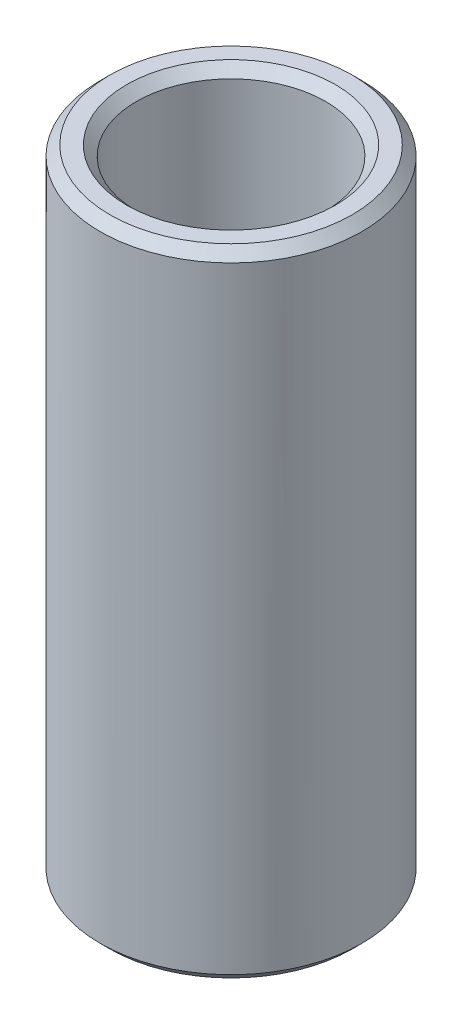
ISO-10303-21;
HEADER;
FILE_DESCRIPTION(('STEP AP214'),'2;1');
FILE_NAME('part.step','',(''),(''),'','','');
FILE_SCHEMA(('AUTOMOTIVE_DESIGN { 1 0 10303 214 1 1 1 1 }'));
ENDSEC;
DATA;
#1=APPLICATION_CONTEXT('core data for automotive mechanical design processes');
#2=APPLICATION_PROTOCOL_DEFINITION('international standard','automotive_design',2000,#1);
#3=PRODUCT_CONTEXT('',#1,'mechanical');
#4=PRODUCT('Part','Part','',(#3));
#5=PRODUCT_RELATED_PRODUCT_CATEGORY('part','',(#4));
#6=PRODUCT_DEFINITION_FORMATION('','',#4);
#7=PRODUCT_DEFINITION_CONTEXT('part definition',#1,'design');
#8=PRODUCT_DEFINITION('design','',#6,#7);
#9=PRODUCT_DEFINITION_SHAPE('','',#8);
#10=(LENGTH_UNIT() NAMED_UNIT(*) SI_UNIT(.MILLI.,.METRE.));
#11=(NAMED_UNIT(*) PLANE_ANGLE_UNIT() SI_UNIT($,.RADIAN.));
#12=(NAMED_UNIT(*) SI_UNIT($,.STERADIAN.) SOLID_ANGLE_UNIT());
#13=UNCERTAINTY_MEASURE_WITH_UNIT(LENGTH_MEASURE(1.E-05),#10,'distance_accuracy_value','');
#14=(GEOMETRIC_REPRESENTATION_CONTEXT(3) GLOBAL_UNCERTAINTY_ASSIGNED_CONTEXT((#13)) GLOBAL_UNIT_ASSIGNED_CONTEXT((#10,
#11,#12)) REPRESENTATION_CONTEXT('',''));
#15=CARTESIAN_POINT('',(0.,0.,0.));
#16=DIRECTION('',(0.,0.,1.));
#17=DIRECTION('',(1.,0.,0.));
#18=AXIS2_PLACEMENT_3D('',#15,#16,#17);
#19=CARTESIAN_POINT('',(0.,206.517811158155,0.));
#20=DIRECTION('',(0.,-1.,0.));
#21=DIRECTION('',(0.,0.,-1.));
#22=AXIS2_PLACEMENT_3D('',#19,#20,#21);
#23=CYLINDRICAL_SURFACE('',#22,42.5);
#24=CARTESIAN_POINT('',(0.,3.16306866676061,0.));
#25=DIRECTION('',(0.,1.,0.));
#26=DIRECTION('',(0.,0.,1.));
#27=AXIS2_PLACEMENT_3D('',#24,#25,#26);
#28=CIRCLE('',#27,42.5);
#29=CARTESIAN_POINT('',(0.,3.16306866676058,-42.5));
#30=VERTEX_POINT('',#29);
#31=EDGE_CURVE('E10',#30,#30,#28,.T.);
#32=CARTESIAN_POINT('',(0.,203.354742491395,0.));
#33=DIRECTION('',(0.,1.,0.));
#34=DIRECTION('',(0.,0.,1.));
#35=AXIS2_PLACEMENT_3D('',#32,#33,#34);
#36=CIRCLE('',#35,42.5);
#37=CARTESIAN_POINT('',(0.,203.354742491395,-42.5));
#38=VERTEX_POINT('',#37);
#39=EDGE_CURVE('E50',#38,#38,#36,.F.);
#40=CARTESIAN_POINT('',(0.,3.16306866676058,-42.5));
#41=CARTESIAN_POINT('',(0.,5.24839860243386,-42.5));
#42=CARTESIAN_POINT('',(0.,7.33372853810713,-42.5));
#43=CARTESIAN_POINT('',(0.,11.5043884094537,-42.5));
#44=CARTESIAN_POINT('',(0.,13.589718345127,-42.5));
#45=CARTESIAN_POINT('',(0.,17.7603782164735,-42.5));
#46=CARTESIAN_POINT('',(0.,19.8457081521468,-42.5));
#47=CARTESIAN_POINT('',(0.,24.0163680234933,-42.5));
#48=CARTESIAN_POINT('',(0.,26.1016979591666,-42.5));
#49=CARTESIAN_POINT('',(0.,30.2723578305131,-42.5));
#50=CARTESIAN_POINT('',(0.,32.3576877661864,-42.5));
#51=CARTESIAN_POINT('',(0.,36.528347637533,-42.5));
#52=CARTESIAN_POINT('',(0.,38.6136775732062,-42.5));
#53=CARTESIAN_POINT('',(0.,42.7843374445528,-42.5));
#54=CARTESIAN_POINT('',(0.,44.8696673802261,-42.5));
#55=CARTESIAN_POINT('',(0.,49.0403272515726,-42.5));
#56=CARTESIAN_POINT('',(0.,51.1256571872459,-42.5));
#57=CARTESIAN_POINT('',(0.,55.2963170585924,-42.5));
#58=CARTESIAN_POINT('',(0.,57.3816469942657,-42.5));
#59=CARTESIAN_POINT('',(0.,61.5523068656123,-42.5));
#60=CARTESIAN_POINT('',(0.,63.6376368012856,-42.5));
#61=CARTESIAN_POINT('',(0.,67.8082966726321,-42.5));
#62=CARTESIAN_POINT('',(0.,69.8936266083054,-42.5));
#63=CARTESIAN_POINT('',(0.,74.0642864796519,-42.5));
#64=CARTESIAN_POINT('',(0.,76.1496164153252,-42.5));
#65=CARTESIAN_POINT('',(0.,80.3202762866717,-42.5));
#66=CARTESIAN_POINT('',(0.,82.405606222345,-42.5));
#67=CARTESIAN_POINT('',(0.,86.5762660936915,-42.5));
#68=CARTESIAN_POINT('',(0.,88.6615960293648,-42.5));
#69=CARTESIAN_POINT('',(0.,92.8322559007114,-42.5));
#70=CARTESIAN_POINT('',(0.,94.9175858363846,-42.5));
#71=CARTESIAN_POINT('',(0.,99.0882457077312,-42.5));
#72=CARTESIAN_POINT('',(0.,101.173575643404,-42.5));
#73=CARTESIAN_POINT('',(0.,105.344235514751,-42.5));
#74=CARTESIAN_POINT('',(0.,107.429565450424,-42.5));
#75=CARTESIAN_POINT('',(0.,111.600225321771,-42.5));
#76=CARTESIAN_POINT('',(0.,113.685555257444,-42.5));
#77=CARTESIAN_POINT('',(0.,117.856215128791,-42.5));
#78=CARTESIAN_POINT('',(0.,119.941545064464,-42.5));
#79=CARTESIAN_POINT('',(0.,124.11220493581,-42.5));
#80=CARTESIAN_POINT('',(0.,126.197534871484,-42.5));
#81=CARTESIAN_POINT('',(0.,130.36819474283,-42.5));
#82=CARTESIAN_POINT('',(0.,132.453524678504,-42.5));
#83=CARTESIAN_POINT('',(0.,136.62418454985,-42.5));
#84=CARTESIAN_POINT('',(0.,138.709514485523,-42.5));
#85=CARTESIAN_POINT('',(0.,142.88017435687,-42.5));
#86=CARTESIAN_POINT('',(0.,144.965504292543,-42.5));
#87=CARTESIAN_POINT('',(0.,149.13616416389,-42.5));
#88=CARTESIAN_POINT('',(0.,151.221494099563,-42.5));
#89=CARTESIAN_POINT('',(0.,155.39215397091,-42.5));
#90=CARTESIAN_POINT('',(0.,157.477483906583,-42.5));
#91=CARTESIAN_POINT('',(0.,161.648143777929,-42.5));
#92=CARTESIAN_POINT('',(0.,163.733473713603,-42.5));
#93=CARTESIAN_POINT('',(0.,167.904133584949,-42.5));
#94=CARTESIAN_POINT('',(0.,169.989463520623,-42.5));
#95=CARTESIAN_POINT('',(0.,174.160123391969,-42.5));
#96=CARTESIAN_POINT('',(0.,176.245453327642,-42.5));
#97=CARTESIAN_POINT('',(0.,180.416113198989,-42.5));
#98=CARTESIAN_POINT('',(0.,182.501443134662,-42.5));
#99=CARTESIAN_POINT('',(0.,186.672103006009,-42.5));
#100=CARTESIAN_POINT('',(0.,188.757432941682,-42.5));
#101=CARTESIAN_POINT('',(0.,192.928092813029,-42.5));
#102=CARTESIAN_POINT('',(0.,195.013422748702,-42.5));
#103=CARTESIAN_POINT('',(0.,199.184082620048,-42.5));
#104=CARTESIAN_POINT('',(0.,201.269412555722,-42.5));
#105=CARTESIAN_POINT('',(0.,203.354742491395,-42.5));
#106=B_SPLINE_CURVE_WITH_KNOTS('',3,(#40,#41,#42,#43,#44,#45,#46,#47,#48,#49,#50,#51,#52,#53,
#54,#55,#56,#57,#58,#59,#60,#61,#62,#63,#64,#65,#66,#67,#68,#69,#70,#71,#72,#73,#74,#75,#76,#77,
#78,#79,#80,#81,#82,#83,#84,#85,#86,#87,#88,#89,#90,#91,#92,#93,#94,#95,#96,#97,#98,#99,#100,
#101,#102,#103,#104,#105),.UNSPECIFIED.,.F.,.F.,(4,2,2,2,2,2,2,2,2,2,2,2,2,2,2,2,2,2,2,2,2,2,2,
2,2,2,2,2,2,2,2,2,4),(0.,6.25598980701983,12.5119796140397,18.7679694210595,25.0239592280793,
31.2799490350991,37.5359388421189,43.7919286491388,50.0479184561586,56.3039082631784,
62.5598980701982,68.815887877218,75.0718776842379,81.3278674912577,87.5838572982775,
93.8398471052973,100.095836912317,106.351826719337,112.607816526357,118.863806333377,
125.119796140396,131.375785947416,137.631775754436,143.887765561456,150.143755368476,
156.399745175496,162.655734982515,168.911724789535,175.167714596555,181.423704403575,
187.679694210595,193.935684017614,200.191673824634),.UNSPECIFIED.);
#107=EDGE_CURVE('BSEAM39',#30,#38,#106,.T.);
#108=ORIENTED_EDGE('',*,*,#31,.T.);
#109=ORIENTED_EDGE('',*,*,#39,.T.);
#110=ORIENTED_EDGE('',*,*,#107,.T.);
#111=ORIENTED_EDGE('',*,*,#107,.F.);
#112=EDGE_LOOP('',(#108,#110,#109,#111));
#113=FACE_BOUND('',#112,.T.);
#114=ADVANCED_FACE('F39',(#113),#23,.T.);
#115=CARTESIAN_POINT('',(0.,206.517811158155,0.));
#116=DIRECTION('',(0.,1.,0.));
#117=DIRECTION('',(0.,0.,1.));
#118=AXIS2_PLACEMENT_3D('',#115,#116,#117);
#119=PLANE('',#118);
#120=CARTESIAN_POINT('',(0.,206.517811158155,0.));
#121=DIRECTION('',(0.,1.,0.));
#122=DIRECTION('',(0.,0.,1.));
#123=AXIS2_PLACEMENT_3D('',#120,#121,#122);
#124=CIRCLE('',#123,33.9195724445905);
#125=CARTESIAN_POINT('',(0.,206.517811158155,33.9195724445905));
#126=VERTEX_POINT('',#125);
#127=EDGE_CURVE('E58',#126,#126,#124,.F.);
#128=ORIENTED_EDGE('',*,*,#127,.T.);
#129=EDGE_LOOP('',(#128));
#130=FACE_BOUND('',#129,.T.);
#131=CARTESIAN_POINT('',(0.,206.517811158155,0.));
#132=DIRECTION('',(0.,1.,0.));
#133=DIRECTION('',(0.,0.,1.));
#134=AXIS2_PLACEMENT_3D('',#131,#132,#133);
#135=CIRCLE('',#134,39.3369313332396);
#136=CARTESIAN_POINT('',(0.,206.517811158155,39.3369313332396));
#137=VERTEX_POINT('',#136);
#138=EDGE_CURVE('E61',#137,#137,#135,.T.);
#139=ORIENTED_EDGE('',*,*,#138,.T.);
#140=EDGE_LOOP('',(#139));
#141=FACE_BOUND('',#140,.T.);
#142=ADVANCED_FACE('F88',(#130,#141),#119,.T.);
#143=CARTESIAN_POINT('',(0.,0.,0.));
#144=DIRECTION('',(0.,1.,0.));
#145=DIRECTION('',(0.,0.,1.));
#146=AXIS2_PLACEMENT_3D('',#143,#144,#145);
#147=PLANE('',#146);
#148=CARTESIAN_POINT('',(0.,0.,0.));
#149=DIRECTION('',(0.,1.,0.));
#150=DIRECTION('',(0.,0.,1.));
#151=AXIS2_PLACEMENT_3D('',#148,#149,#150);
#152=CIRCLE('',#151,33.9195724445903);
#153=CARTESIAN_POINT('',(0.,0.,33.9195724445903));
#154=VERTEX_POINT('',#153);
#155=EDGE_CURVE('E51',#154,#154,#152,.T.);
#156=ORIENTED_EDGE('',*,*,#155,.T.);
#157=EDGE_LOOP('',(#156));
#158=FACE_BOUND('',#157,.T.);
#159=CARTESIAN_POINT('',(0.,0.,0.));
#160=DIRECTION('',(0.,1.,0.));
#161=DIRECTION('',(0.,0.,1.));
#162=AXIS2_PLACEMENT_3D('',#159,#160,#161);
#163=CIRCLE('',#162,39.3369313332394);
#164=CARTESIAN_POINT('',(0.,0.,39.3369313332394));
#165=VERTEX_POINT('',#164);
#166=EDGE_CURVE('E54',#165,#165,#163,.F.);
#167=ORIENTED_EDGE('',*,*,#166,.T.);
#168=EDGE_LOOP('',(#167));
#169=FACE_BOUND('',#168,.T.);
#170=ADVANCED_FACE('F83',(#158,#169),#147,.F.);
#171=CARTESIAN_POINT('',(0.,206.517811158155,0.));
#172=DIRECTION('',(0.,-1.,0.));
#173=DIRECTION('',(0.,0.,-1.));
#174=AXIS2_PLACEMENT_3D('',#171,#172,#173);
#175=CYLINDRICAL_SURFACE('',#174,30.7565037778299);
#176=CARTESIAN_POINT('',(0.,203.354742491395,0.));
#177=DIRECTION('',(0.,1.,0.));
#178=DIRECTION('',(0.,0.,1.));
#179=AXIS2_PLACEMENT_3D('',#176,#177,#178);
#180=CIRCLE('',#179,30.7565037778299);
#181=CARTESIAN_POINT('',(0.,203.354742491395,-30.7565037778299));
#182=VERTEX_POINT('',#181);
#183=EDGE_CURVE('E67',#182,#182,#180,.T.);
#184=CARTESIAN_POINT('',(0.,3.16306866676042,0.));
#185=DIRECTION('',(0.,1.,0.));
#186=DIRECTION('',(0.,0.,1.));
#187=AXIS2_PLACEMENT_3D('',#184,#185,#186);
#188=CIRCLE('',#187,30.7565037778299);
#189=CARTESIAN_POINT('',(0.,3.16306866676042,-30.7565037778299));
#190=VERTEX_POINT('',#189);
#191=EDGE_CURVE('E69',#190,#190,#188,.F.);
#192=CARTESIAN_POINT('',(0.,203.354742491395,-30.7565037778299));
#193=CARTESIAN_POINT('',(0.,201.269412555721,-30.7565037778299));
#194=CARTESIAN_POINT('',(0.,199.184082620048,-30.7565037778299));
#195=CARTESIAN_POINT('',(0.,195.013422748702,-30.7565037778299));
#196=CARTESIAN_POINT('',(0.,192.928092813028,-30.7565037778299));
#197=CARTESIAN_POINT('',(0.,188.757432941682,-30.7565037778299));
#198=CARTESIAN_POINT('',(0.,186.672103006008,-30.7565037778299));
#199=CARTESIAN_POINT('',(0.,182.501443134662,-30.7565037778299));
#200=CARTESIAN_POINT('',(0.,180.416113198989,-30.7565037778299));
#201=CARTESIAN_POINT('',(0.,176.245453327642,-30.7565037778299));
#202=CARTESIAN_POINT('',(0.,174.160123391969,-30.7565037778299));
#203=CARTESIAN_POINT('',(0.,169.989463520622,-30.7565037778299));
#204=CARTESIAN_POINT('',(0.,167.904133584949,-30.7565037778299));
#205=CARTESIAN_POINT('',(0.,163.733473713602,-30.7565037778299));
#206=CARTESIAN_POINT('',(0.,161.648143777929,-30.7565037778299));
#207=CARTESIAN_POINT('',(0.,157.477483906583,-30.7565037778299));
#208=CARTESIAN_POINT('',(0.,155.392153970909,-30.7565037778299));
#209=CARTESIAN_POINT('',(0.,151.221494099563,-30.7565037778299));
#210=CARTESIAN_POINT('',(0.,149.13616416389,-30.7565037778299));
#211=CARTESIAN_POINT('',(0.,144.965504292543,-30.7565037778299));
#212=CARTESIAN_POINT('',(0.,142.88017435687,-30.7565037778299));
#213=CARTESIAN_POINT('',(0.,138.709514485523,-30.7565037778299));
#214=CARTESIAN_POINT('',(0.,136.62418454985,-30.7565037778299));
#215=CARTESIAN_POINT('',(0.,132.453524678503,-30.7565037778299));
#216=CARTESIAN_POINT('',(0.,130.36819474283,-30.7565037778299));
#217=CARTESIAN_POINT('',(0.,126.197534871484,-30.7565037778299));
#218=CARTESIAN_POINT('',(0.,124.11220493581,-30.7565037778299));
#219=CARTESIAN_POINT('',(0.,119.941545064464,-30.7565037778299));
#220=CARTESIAN_POINT('',(0.,117.85621512879,-30.7565037778299));
#221=CARTESIAN_POINT('',(0.,113.685555257444,-30.7565037778299));
#222=CARTESIAN_POINT('',(0.,111.600225321771,-30.7565037778299));
#223=CARTESIAN_POINT('',(0.,107.429565450424,-30.7565037778299));
#224=CARTESIAN_POINT('',(0.,105.344235514751,-30.7565037778299));
#225=CARTESIAN_POINT('',(0.,101.173575643404,-30.7565037778299));
#226=CARTESIAN_POINT('',(0.,99.088245707731,-30.7565037778299));
#227=CARTESIAN_POINT('',(0.,94.9175858363844,-30.7565037778299));
#228=CARTESIAN_POINT('',(0.,92.8322559007111,-30.7565037778299));
#229=CARTESIAN_POINT('',(0.,88.6615960293646,-30.7565037778299));
#230=CARTESIAN_POINT('',(0.,86.5762660936913,-30.7565037778299));
#231=CARTESIAN_POINT('',(0.,82.4056062223448,-30.7565037778299));
#232=CARTESIAN_POINT('',(0.,80.3202762866715,-30.7565037778299));
#233=CARTESIAN_POINT('',(0.,76.149616415325,-30.7565037778299));
#234=CARTESIAN_POINT('',(0.,74.0642864796517,-30.7565037778299));
#235=CARTESIAN_POINT('',(0.,69.8936266083052,-30.7565037778299));
#236=CARTESIAN_POINT('',(0.,67.8082966726319,-30.7565037778299));
#237=CARTESIAN_POINT('',(0.,63.6376368012853,-30.7565037778299));
#238=CARTESIAN_POINT('',(0.,61.5523068656121,-30.7565037778299));
#239=CARTESIAN_POINT('',(0.,57.3816469942655,-30.7565037778299));
#240=CARTESIAN_POINT('',(0.,55.2963170585923,-30.7565037778299));
#241=CARTESIAN_POINT('',(0.,51.1256571872457,-30.7565037778299));
#242=CARTESIAN_POINT('',(0.,49.0403272515724,-30.7565037778299));
#243=CARTESIAN_POINT('',(0.,44.8696673802259,-30.7565037778299));
#244=CARTESIAN_POINT('',(0.,42.7843374445526,-30.7565037778299));
#245=CARTESIAN_POINT('',(0.,38.6136775732061,-30.7565037778299));
#246=CARTESIAN_POINT('',(0.,36.5283476375328,-30.7565037778299));
#247=CARTESIAN_POINT('',(0.,32.3576877661862,-30.7565037778299));
#248=CARTESIAN_POINT('',(0.,30.2723578305129,-30.7565037778299));
#249=CARTESIAN_POINT('',(0.,26.1016979591664,-30.7565037778299));
#250=CARTESIAN_POINT('',(0.,24.0163680234931,-30.7565037778299));
#251=CARTESIAN_POINT('',(0.,19.8457081521466,-30.7565037778299));
#252=CARTESIAN_POINT('',(0.,17.7603782164733,-30.7565037778299));
#253=CARTESIAN_POINT('',(0.,13.5897183451268,-30.7565037778299));
#254=CARTESIAN_POINT('',(0.,11.5043884094535,-30.7565037778299));
#255=CARTESIAN_POINT('',(0.,7.33372853810695,-30.7565037778299));
#256=CARTESIAN_POINT('',(0.,5.24839860243368,-30.7565037778299));
#257=CARTESIAN_POINT('',(0.,3.16306866676042,-30.7565037778299));
#258=B_SPLINE_CURVE_WITH_KNOTS('',3,(#192,#193,#194,#195,#196,#197,#198,#199,#200,#201,#202,
#203,#204,#205,#206,#207,#208,#209,#210,#211,#212,#213,#214,#215,#216,#217,#218,#219,#220,#221,
#222,#223,#224,#225,#226,#227,#228,#229,#230,#231,#232,#233,#234,#235,#236,#237,#238,#239,#240,
#241,#242,#243,#244,#245,#246,#247,#248,#249,#250,#251,#252,#253,#254,#255,#256,#257),
.UNSPECIFIED.,.F.,.F.,(4,2,2,2,2,2,2,2,2,2,2,2,2,2,2,2,2,2,2,2,2,2,2,2,2,2,2,2,2,2,2,2,4),(0.,
6.25598980701983,12.5119796140397,18.7679694210595,25.0239592280793,31.2799490350991,
37.5359388421189,43.7919286491388,50.0479184561586,56.3039082631784,62.5598980701982,
68.815887877218,75.0718776842378,81.3278674912577,87.5838572982775,93.8398471052973,
100.095836912317,106.351826719337,112.607816526357,118.863806333377,125.119796140396,
131.375785947416,137.631775754436,143.887765561456,150.143755368476,156.399745175496,
162.655734982515,168.911724789535,175.167714596555,181.423704403575,187.679694210595,
193.935684017614,200.191673824634),.UNSPECIFIED.);
#259=EDGE_CURVE('BSEAM71',#182,#190,#258,.T.);
#260=ORIENTED_EDGE('',*,*,#183,.T.);
#261=ORIENTED_EDGE('',*,*,#191,.T.);
#262=ORIENTED_EDGE('',*,*,#259,.T.);
#263=ORIENTED_EDGE('',*,*,#259,.F.);
#264=EDGE_LOOP('',(#260,#262,#261,#263));
#265=FACE_BOUND('',#264,.T.);
#266=ADVANCED_FACE('F71',(#265),#175,.F.);
#267=CARTESIAN_POINT('',(0.,203.354742491395,0.));
#268=DIRECTION('',(0.,1.,0.));
#269=DIRECTION('',(0.,0.,1.));
#270=AXIS2_PLACEMENT_3D('',#267,#268,#269);
#271=CONICAL_SURFACE('',#270,30.7565037778299,0.785398163397447);
#272=ORIENTED_EDGE('',*,*,#127,.F.);
#273=EDGE_LOOP('',(#272));
#274=FACE_BOUND('',#273,.T.);
#275=ORIENTED_EDGE('',*,*,#183,.F.);
#276=EDGE_LOOP('',(#275));
#277=FACE_BOUND('',#276,.T.);
#278=ADVANCED_FACE('F77',(#274,#277),#271,.F.);
#279=CARTESIAN_POINT('',(0.,0.,0.));
#280=DIRECTION('',(0.,-1.,0.));
#281=DIRECTION('',(0.,0.,-1.));
#282=AXIS2_PLACEMENT_3D('',#279,#280,#281);
#283=CONICAL_SURFACE('',#282,33.9195724445903,0.785398163397446);
#284=ORIENTED_EDGE('',*,*,#191,.F.);
#285=EDGE_LOOP('',(#284));
#286=FACE_BOUND('',#285,.T.);
#287=ORIENTED_EDGE('',*,*,#155,.F.);
#288=EDGE_LOOP('',(#287));
#289=FACE_BOUND('',#288,.T.);
#290=ADVANCED_FACE('F73',(#286,#289),#283,.F.);
#291=CARTESIAN_POINT('',(0.,3.16306866676061,0.));
#292=DIRECTION('',(0.,1.,0.));
#293=DIRECTION('',(0.,0.,1.));
#294=AXIS2_PLACEMENT_3D('',#291,#292,#293);
#295=CONICAL_SURFACE('',#294,42.5,0.785398163397449);
#296=ORIENTED_EDGE('',*,*,#166,.F.);
#297=EDGE_LOOP('',(#296));
#298=FACE_BOUND('',#297,.T.);
#299=ORIENTED_EDGE('',*,*,#31,.F.);
#300=EDGE_LOOP('',(#299));
#301=FACE_BOUND('',#300,.T.);
#302=ADVANCED_FACE('F76',(#298,#301),#295,.T.);
#303=CARTESIAN_POINT('',(0.,206.517811158155,0.));
#304=DIRECTION('',(0.,-1.,0.));
#305=DIRECTION('',(0.,0.,-1.));
#306=AXIS2_PLACEMENT_3D('',#303,#304,#305);
#307=CONICAL_SURFACE('',#306,39.3369313332396,0.785398163397445);
#308=ORIENTED_EDGE('',*,*,#39,.F.);
#309=EDGE_LOOP('',(#308));
#310=FACE_BOUND('',#309,.T.);
#311=ORIENTED_EDGE('',*,*,#138,.F.);
#312=EDGE_LOOP('',(#311));
#313=FACE_BOUND('',#312,.T.);
#314=ADVANCED_FACE('F45',(#310,#313),#307,.T.);
#315=CLOSED_SHELL('',(#114,#142,#170,#266,#278,#290,#302,#314));
#316=MANIFOLD_SOLID_BREP('B2',#315);
#317=ADVANCED_BREP_SHAPE_REPRESENTATION('',(#18,#316),#14);
#318=SHAPE_DEFINITION_REPRESENTATION(#9,#317);
ENDSEC;
END-ISO-10303-21;
